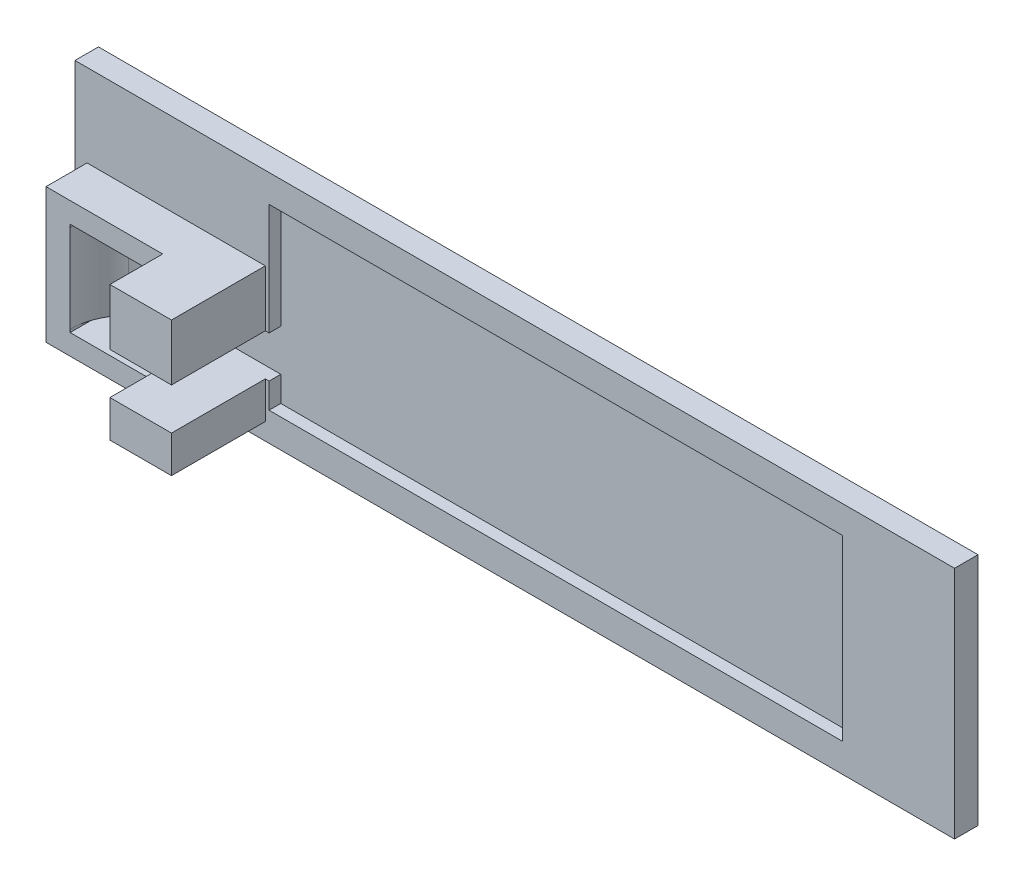
ISO-10303-21;
HEADER;
FILE_DESCRIPTION(('STEP AP214'),'2;1');
FILE_NAME('part.step','',(''),(''),'','','');
FILE_SCHEMA(('AUTOMOTIVE_DESIGN { 1 0 10303 214 1 1 1 1 }'));
ENDSEC;
DATA;
#1=APPLICATION_CONTEXT('core data for automotive mechanical design processes');
#2=APPLICATION_PROTOCOL_DEFINITION('international standard','automotive_design',2000,#1);
#3=PRODUCT_CONTEXT('',#1,'mechanical');
#4=PRODUCT('Part','Part','',(#3));
#5=PRODUCT_RELATED_PRODUCT_CATEGORY('part','',(#4));
#6=PRODUCT_DEFINITION_FORMATION('','',#4);
#7=PRODUCT_DEFINITION_CONTEXT('part definition',#1,'design');
#8=PRODUCT_DEFINITION('design','',#6,#7);
#9=PRODUCT_DEFINITION_SHAPE('','',#8);
#10=(LENGTH_UNIT() NAMED_UNIT(*) SI_UNIT(.MILLI.,.METRE.));
#11=(NAMED_UNIT(*) PLANE_ANGLE_UNIT() SI_UNIT($,.RADIAN.));
#12=(NAMED_UNIT(*) SI_UNIT($,.STERADIAN.) SOLID_ANGLE_UNIT());
#13=UNCERTAINTY_MEASURE_WITH_UNIT(LENGTH_MEASURE(1.E-05),#10,'distance_accuracy_value','');
#14=(GEOMETRIC_REPRESENTATION_CONTEXT(3) GLOBAL_UNCERTAINTY_ASSIGNED_CONTEXT((#13)) GLOBAL_UNIT_ASSIGNED_CONTEXT((#10,
#11,#12)) REPRESENTATION_CONTEXT('',''));
#15=CARTESIAN_POINT('',(0.,0.,0.));
#16=DIRECTION('',(0.,0.,1.));
#17=DIRECTION('',(1.,0.,0.));
#18=AXIS2_PLACEMENT_3D('',#15,#16,#17);
#19=CARTESIAN_POINT('',(0.,0.,9.));
#20=DIRECTION('',(0.,0.,-1.));
#21=DIRECTION('',(-1.,0.,0.));
#22=AXIS2_PLACEMENT_3D('',#19,#20,#21);
#23=PLANE('',#22);
#24=DIRECTION('',(0.,-1.,0.));
#25=VECTOR('',#24,1.);
#26=CARTESIAN_POINT('',(0.5,0.,9.));
#27=LINE('',#26,#25);
#28=CARTESIAN_POINT('',(0.5,-2.8,9.));
#29=VERTEX_POINT('',#28);
#30=CARTESIAN_POINT('',(0.5,-6.29709494860346,9.));
#31=VERTEX_POINT('',#30);
#32=EDGE_CURVE('E268',#29,#31,#27,.T.);
#33=ORIENTED_EDGE('',*,*,#32,.F.);
#34=DIRECTION('',(1.,0.,0.));
#35=VECTOR('',#34,1.);
#36=CARTESIAN_POINT('',(0.500000000000001,-2.8,9.));
#37=LINE('',#36,#35);
#38=CARTESIAN_POINT('',(-15.2908120194392,-2.8,9.));
#39=VERTEX_POINT('',#38);
#40=EDGE_CURVE('E372',#39,#29,#37,.T.);
#41=ORIENTED_EDGE('',*,*,#40,.F.);
#42=DIRECTION('',(0.,-1.,0.));
#43=VECTOR('',#42,1.);
#44=CARTESIAN_POINT('',(-15.2908120194392,-2.3,9.));
#45=LINE('',#44,#43);
#46=CARTESIAN_POINT('',(-15.2908120194392,-2.3,9.));
#47=VERTEX_POINT('',#46);
#48=EDGE_CURVE('E328',#47,#39,#45,.T.);
#49=ORIENTED_EDGE('',*,*,#48,.F.);
#50=DIRECTION('',(0.,-1.,0.));
#51=VECTOR('',#50,1.);
#52=CARTESIAN_POINT('',(-15.2908120194392,26.6352944540203,9.));
#53=LINE('',#52,#51);
#54=CARTESIAN_POINT('',(-15.2908120194392,12.7,9.));
#55=VERTEX_POINT('',#54);
#56=EDGE_CURVE('E406',#55,#47,#53,.T.);
#57=ORIENTED_EDGE('',*,*,#56,.F.);
#58=DIRECTION('',(0.,-1.,0.));
#59=VECTOR('',#58,1.);
#60=CARTESIAN_POINT('',(-15.2908120194392,12.7,9.));
#61=LINE('',#60,#59);
#62=CARTESIAN_POINT('',(-15.2908120194392,13.2,9.));
#63=VERTEX_POINT('',#62);
#64=EDGE_CURVE('E343',#63,#55,#61,.T.);
#65=ORIENTED_EDGE('',*,*,#64,.F.);
#66=DIRECTION('',(-1.,0.,0.));
#67=VECTOR('',#66,1.);
#68=CARTESIAN_POINT('',(-15.2908120194392,13.2,9.));
#69=LINE('',#68,#67);
#70=CARTESIAN_POINT('',(0.5,13.2,9.));
#71=VERTEX_POINT('',#70);
#72=EDGE_CURVE('E340',#71,#63,#69,.T.);
#73=ORIENTED_EDGE('',*,*,#72,.F.);
#74=DIRECTION('',(0.,-1.,0.));
#75=VECTOR('',#74,1.);
#76=CARTESIAN_POINT('',(0.5,7.1,9.));
#77=LINE('',#76,#75);
#78=CARTESIAN_POINT('',(0.5,16.6970991621456,9.));
#79=VERTEX_POINT('',#78);
#80=EDGE_CURVE('E277',#79,#71,#77,.T.);
#81=ORIENTED_EDGE('',*,*,#80,.F.);
#82=DIRECTION('',(-1.,0.,0.));
#83=VECTOR('',#82,1.);
#84=CARTESIAN_POINT('',(4.,16.6970991621456,9.));
#85=LINE('',#84,#83);
#86=CARTESIAN_POINT('',(-19.4000608526604,16.6970991621456,9.));
#87=VERTEX_POINT('',#86);
#88=EDGE_CURVE('E424',#79,#87,#85,.T.);
#89=ORIENTED_EDGE('',*,*,#88,.T.);
#90=DIRECTION('',(0.,-1.,0.));
#91=VECTOR('',#90,1.);
#92=CARTESIAN_POINT('',(-19.4000608526604,26.6352944540203,9.));
#93=LINE('',#92,#91);
#94=CARTESIAN_POINT('',(-19.4000608526604,-6.29709494860346,9.));
#95=VERTEX_POINT('',#94);
#96=EDGE_CURVE('E400',#87,#95,#93,.T.);
#97=ORIENTED_EDGE('',*,*,#96,.T.);
#98=DIRECTION('',(1.,0.,0.));
#99=VECTOR('',#98,1.);
#100=CARTESIAN_POINT('',(-12.3454364360499,-6.29709494860346,9.));
#101=LINE('',#100,#99);
#102=EDGE_CURVE('E251',#95,#31,#101,.T.);
#103=ORIENTED_EDGE('',*,*,#102,.T.);
#104=EDGE_LOOP('',(#33,#41,#49,#57,#65,#73,#81,#89,#97,#103));
#105=FACE_BOUND('',#104,.T.);
#106=ADVANCED_FACE('F34',(#105),#23,.F.);
#107=CARTESIAN_POINT('',(-5.5,-2.3,9.2));
#108=DIRECTION('',(0.,1.,0.));
#109=DIRECTION('',(0.,0.,1.));
#110=AXIS2_PLACEMENT_3D('',#107,#108,#109);
#111=PLANE('',#110);
#112=CARTESIAN_POINT('',(-5.5,-2.3,9.2));
#113=DIRECTION('',(0.,1.,0.));
#114=DIRECTION('',(0.,0.,1.));
#115=AXIS2_PLACEMENT_3D('',#112,#113,#114);
#116=CIRCLE('',#115,10.0404183179786);
#117=CARTESIAN_POINT('',(-1.47880614742339,-2.3,0.));
#118=VERTEX_POINT('',#117);
#119=CARTESIAN_POINT('',(-9.52119385257661,-2.3,0.));
#120=VERTEX_POINT('',#119);
#121=EDGE_CURVE('E438',#118,#120,#116,.T.);
#122=ORIENTED_EDGE('',*,*,#121,.T.);
#123=DIRECTION('',(1.,0.,0.));
#124=VECTOR('',#123,1.);
#125=CARTESIAN_POINT('',(-15.2908120194392,-2.3,0.));
#126=LINE('',#125,#124);
#127=EDGE_CURVE('E368',#120,#118,#126,.T.);
#128=ORIENTED_EDGE('',*,*,#127,.T.);
#129=EDGE_LOOP('',(#122,#128));
#130=FACE_BOUND('',#129,.T.);
#131=ADVANCED_FACE('F605',(#130),#111,.T.);
#132=CARTESIAN_POINT('',(-5.5,12.7,9.2));
#133=DIRECTION('',(0.,1.,0.));
#134=DIRECTION('',(0.,0.,1.));
#135=AXIS2_PLACEMENT_3D('',#132,#133,#134);
#136=PLANE('',#135);
#137=DIRECTION('',(-1.,0.,0.));
#138=VECTOR('',#137,1.);
#139=CARTESIAN_POINT('',(0.,12.7,0.));
#140=LINE('',#139,#138);
#141=CARTESIAN_POINT('',(-1.47880614742338,12.7,0.));
#142=VERTEX_POINT('',#141);
#143=CARTESIAN_POINT('',(-9.52119385257661,12.7,0.));
#144=VERTEX_POINT('',#143);
#145=EDGE_CURVE('E339',#142,#144,#140,.T.);
#146=ORIENTED_EDGE('',*,*,#145,.T.);
#147=CARTESIAN_POINT('',(-5.5,12.7,9.2));
#148=DIRECTION('',(0.,1.,0.));
#149=DIRECTION('',(0.,0.,1.));
#150=AXIS2_PLACEMENT_3D('',#147,#148,#149);
#151=CIRCLE('',#150,10.0404183179786);
#152=EDGE_CURVE('E434',#142,#144,#151,.T.);
#153=ORIENTED_EDGE('',*,*,#152,.F.);
#154=EDGE_LOOP('',(#146,#153));
#155=FACE_BOUND('',#154,.T.);
#156=ADVANCED_FACE('F588',(#155),#136,.F.);
#157=CARTESIAN_POINT('',(0.,0.,2.));
#158=DIRECTION('',(0.,0.,1.));
#159=DIRECTION('',(1.,0.,0.));
#160=AXIS2_PLACEMENT_3D('',#157,#158,#159);
#161=PLANE('',#160);
#162=DIRECTION('',(0.,-1.,0.));
#163=VECTOR('',#162,1.);
#164=CARTESIAN_POINT('',(11.6394275827029,7.1,2.));
#165=LINE('',#164,#163);
#166=CARTESIAN_POINT('',(11.6394275827029,26.1,2.));
#167=VERTEX_POINT('',#166);
#168=CARTESIAN_POINT('',(11.6394275827029,7.1,2.));
#169=VERTEX_POINT('',#168);
#170=EDGE_CURVE('E316',#167,#169,#165,.T.);
#171=ORIENTED_EDGE('',*,*,#170,.F.);
#172=DIRECTION('',(-1.,0.,0.));
#173=VECTOR('',#172,1.);
#174=CARTESIAN_POINT('',(11.6394275827029,26.1,2.));
#175=LINE('',#174,#173);
#176=CARTESIAN_POINT('',(109.411442142703,26.1,2.));
#177=VERTEX_POINT('',#176);
#178=EDGE_CURVE('E312',#177,#167,#175,.T.);
#179=ORIENTED_EDGE('',*,*,#178,.F.);
#180=DIRECTION('',(0.,1.,0.));
#181=VECTOR('',#180,1.);
#182=CARTESIAN_POINT('',(109.411442142703,26.1,2.));
#183=LINE('',#182,#181);
#184=CARTESIAN_POINT('',(109.411442142703,-4.30823185,2.));
#185=VERTEX_POINT('',#184);
#186=EDGE_CURVE('E309',#185,#177,#183,.T.);
#187=ORIENTED_EDGE('',*,*,#186,.F.);
#188=DIRECTION('',(1.,0.,0.));
#189=VECTOR('',#188,1.);
#190=CARTESIAN_POINT('',(11.6394275827029,-4.30823185,2.));
#191=LINE('',#190,#189);
#192=CARTESIAN_POINT('',(11.6394275827029,-4.30823185,2.));
#193=VERTEX_POINT('',#192);
#194=EDGE_CURVE('E292',#193,#185,#191,.T.);
#195=ORIENTED_EDGE('',*,*,#194,.F.);
#196=CARTESIAN_POINT('',(11.6394275827029,0.,2.));
#197=VERTEX_POINT('',#196);
#198=EDGE_CURVE('E315',#197,#193,#165,.T.);
#199=ORIENTED_EDGE('',*,*,#198,.F.);
#200=DIRECTION('',(1.,0.,0.));
#201=VECTOR('',#200,1.);
#202=CARTESIAN_POINT('',(12.1958891942608,0.,2.));
#203=LINE('',#202,#201);
#204=CARTESIAN_POINT('',(11.,0.,2.));
#205=VERTEX_POINT('',#204);
#206=EDGE_CURVE('E462',#205,#197,#203,.T.);
#207=ORIENTED_EDGE('',*,*,#206,.F.);
#208=DIRECTION('',(0.,-1.,0.));
#209=VECTOR('',#208,1.);
#210=CARTESIAN_POINT('',(11.,0.,2.));
#211=LINE('',#210,#209);
#212=CARTESIAN_POINT('',(11.,-6.29709494860346,2.));
#213=VERTEX_POINT('',#212);
#214=EDGE_CURVE('E247',#205,#213,#211,.T.);
#215=ORIENTED_EDGE('',*,*,#214,.T.);
#216=DIRECTION('',(-1.,0.,0.));
#217=VECTOR('',#216,1.);
#218=CARTESIAN_POINT('',(0.,-6.29709494860346,2.));
#219=LINE('',#218,#217);
#220=CARTESIAN_POINT('',(-19.4000608526604,-6.29709494860346,2.));
#221=VERTEX_POINT('',#220);
#222=EDGE_CURVE('E11',#213,#221,#219,.T.);
#223=ORIENTED_EDGE('',*,*,#222,.T.);
#224=DIRECTION('',(0.,-1.,0.));
#225=VECTOR('',#224,1.);
#226=CARTESIAN_POINT('',(-19.4000608526604,26.6352944540203,2.));
#227=LINE('',#226,#225);
#228=CARTESIAN_POINT('',(-19.4000608526604,16.6970991621456,2.));
#229=VERTEX_POINT('',#228);
#230=EDGE_CURVE('E395',#229,#221,#227,.T.);
#231=ORIENTED_EDGE('',*,*,#230,.F.);
#232=DIRECTION('',(1.,0.,0.));
#233=VECTOR('',#232,1.);
#234=CARTESIAN_POINT('',(0.,16.6970991621456,2.));
#235=LINE('',#234,#233);
#236=CARTESIAN_POINT('',(11.,16.6970991621456,2.));
#237=VERTEX_POINT('',#236);
#238=EDGE_CURVE('E42',#229,#237,#235,.T.);
#239=ORIENTED_EDGE('',*,*,#238,.T.);
#240=DIRECTION('',(0.,-1.,0.));
#241=VECTOR('',#240,1.);
#242=CARTESIAN_POINT('',(11.,0.,2.));
#243=LINE('',#242,#241);
#244=CARTESIAN_POINT('',(11.,7.1,2.));
#245=VERTEX_POINT('',#244);
#246=EDGE_CURVE('E431',#237,#245,#243,.T.);
#247=ORIENTED_EDGE('',*,*,#246,.T.);
#248=DIRECTION('',(-1.,0.,0.));
#249=VECTOR('',#248,1.);
#250=CARTESIAN_POINT('',(11.6394275827029,7.1,2.));
#251=LINE('',#250,#249);
#252=EDGE_CURVE('E459',#169,#245,#251,.T.);
#253=ORIENTED_EDGE('',*,*,#252,.F.);
#254=EDGE_LOOP('',(#171,#179,#187,#195,#199,#207,#215,#223,#231,#239,#247,#253));
#255=FACE_BOUND('',#254,.T.);
#256=DIRECTION('',(0.,-1.,0.));
#257=VECTOR('',#256,1.);
#258=CARTESIAN_POINT('',(-21.4577063823923,30.8029359885804,2.));
#259=LINE('',#258,#257);
#260=CARTESIAN_POINT('',(-21.4577063823923,30.8029359885804,2.));
#261=VERTEX_POINT('',#260);
#262=CARTESIAN_POINT('',(-21.4577063823923,-9.19706401141962,2.));
#263=VERTEX_POINT('',#262);
#264=EDGE_CURVE('E473',#261,#263,#259,.T.);
#265=ORIENTED_EDGE('',*,*,#264,.T.);
#266=DIRECTION('',(1.,0.,0.));
#267=VECTOR('',#266,1.);
#268=CARTESIAN_POINT('',(-21.4577063823923,-9.19706401141962,2.));
#269=LINE('',#268,#267);
#270=CARTESIAN_POINT('',(128.542293617608,-9.19706401141962,2.));
#271=VERTEX_POINT('',#270);
#272=EDGE_CURVE('E475',#263,#271,#269,.T.);
#273=ORIENTED_EDGE('',*,*,#272,.T.);
#274=DIRECTION('',(0.,1.,0.));
#275=VECTOR('',#274,1.);
#276=CARTESIAN_POINT('',(128.542293617608,30.8029359885804,2.));
#277=LINE('',#276,#275);
#278=CARTESIAN_POINT('',(128.542293617608,30.8029359885804,2.));
#279=VERTEX_POINT('',#278);
#280=EDGE_CURVE('E477',#271,#279,#277,.T.);
#281=ORIENTED_EDGE('',*,*,#280,.T.);
#282=DIRECTION('',(-1.,0.,0.));
#283=VECTOR('',#282,1.);
#284=CARTESIAN_POINT('',(-21.4577063823923,30.8029359885804,2.));
#285=LINE('',#284,#283);
#286=EDGE_CURVE('E57',#279,#261,#285,.T.);
#287=ORIENTED_EDGE('',*,*,#286,.T.);
#288=EDGE_LOOP('',(#265,#273,#281,#287));
#289=FACE_BOUND('',#288,.T.);
#290=ADVANCED_FACE('F491',(#255,#289),#161,.T.);
#291=CARTESIAN_POINT('',(-21.4577063823923,30.8029359885804,2.));
#292=DIRECTION('',(1.,0.,0.));
#293=DIRECTION('',(0.,0.,-1.));
#294=AXIS2_PLACEMENT_3D('',#291,#292,#293);
#295=PLANE('',#294);
#296=DIRECTION('',(0.,0.,-1.));
#297=VECTOR('',#296,1.);
#298=CARTESIAN_POINT('',(-21.4577063823923,30.8029359885804,2.));
#299=LINE('',#298,#297);
#300=CARTESIAN_POINT('',(-21.4577063823923,30.8029359885804,-2.));
#301=VERTEX_POINT('',#300);
#302=EDGE_CURVE('E480',#261,#301,#299,.T.);
#303=ORIENTED_EDGE('',*,*,#302,.T.);
#304=DIRECTION('',(0.,-1.,0.));
#305=VECTOR('',#304,1.);
#306=CARTESIAN_POINT('',(-21.4577063823923,30.8029359885804,-2.));
#307=LINE('',#306,#305);
#308=CARTESIAN_POINT('',(-21.4577063823923,-9.19706401141962,-2.));
#309=VERTEX_POINT('',#308);
#310=EDGE_CURVE('E446',#301,#309,#307,.T.);
#311=ORIENTED_EDGE('',*,*,#310,.T.);
#312=DIRECTION('',(0.,0.,-1.));
#313=VECTOR('',#312,1.);
#314=CARTESIAN_POINT('',(-21.4577063823923,-9.19706401141962,2.));
#315=LINE('',#314,#313);
#316=EDGE_CURVE('E486',#263,#309,#315,.T.);
#317=ORIENTED_EDGE('',*,*,#316,.F.);
#318=ORIENTED_EDGE('',*,*,#264,.F.);
#319=EDGE_LOOP('',(#303,#311,#317,#318));
#320=FACE_BOUND('',#319,.T.);
#321=ADVANCED_FACE('F36',(#320),#295,.F.);
#322=CARTESIAN_POINT('',(-21.4577063823923,-9.19706401141962,2.));
#323=DIRECTION('',(0.,1.,0.));
#324=DIRECTION('',(0.,0.,1.));
#325=AXIS2_PLACEMENT_3D('',#322,#323,#324);
#326=PLANE('',#325);
#327=ORIENTED_EDGE('',*,*,#316,.T.);
#328=DIRECTION('',(1.,0.,0.));
#329=VECTOR('',#328,1.);
#330=CARTESIAN_POINT('',(-21.4577063823923,-9.19706401141962,-2.));
#331=LINE('',#330,#329);
#332=CARTESIAN_POINT('',(128.542293617608,-9.19706401141962,-2.));
#333=VERTEX_POINT('',#332);
#334=EDGE_CURVE('E449',#309,#333,#331,.T.);
#335=ORIENTED_EDGE('',*,*,#334,.T.);
#336=DIRECTION('',(0.,0.,-1.));
#337=VECTOR('',#336,1.);
#338=CARTESIAN_POINT('',(128.542293617608,-9.19706401141962,2.));
#339=LINE('',#338,#337);
#340=EDGE_CURVE('E484',#271,#333,#339,.T.);
#341=ORIENTED_EDGE('',*,*,#340,.F.);
#342=ORIENTED_EDGE('',*,*,#272,.F.);
#343=EDGE_LOOP('',(#327,#335,#341,#342));
#344=FACE_BOUND('',#343,.T.);
#345=ADVANCED_FACE('F638',(#344),#326,.F.);
#346=CARTESIAN_POINT('',(128.542293617608,30.8029359885804,2.));
#347=DIRECTION('',(-1.,0.,0.));
#348=DIRECTION('',(0.,0.,1.));
#349=AXIS2_PLACEMENT_3D('',#346,#347,#348);
#350=PLANE('',#349);
#351=ORIENTED_EDGE('',*,*,#340,.T.);
#352=DIRECTION('',(0.,1.,0.));
#353=VECTOR('',#352,1.);
#354=CARTESIAN_POINT('',(128.542293617608,30.8029359885804,-2.));
#355=LINE('',#354,#353);
#356=CARTESIAN_POINT('',(128.542293617608,30.8029359885804,-2.));
#357=VERTEX_POINT('',#356);
#358=EDGE_CURVE('E452',#333,#357,#355,.T.);
#359=ORIENTED_EDGE('',*,*,#358,.T.);
#360=DIRECTION('',(0.,0.,-1.));
#361=VECTOR('',#360,1.);
#362=CARTESIAN_POINT('',(128.542293617608,30.8029359885804,2.));
#363=LINE('',#362,#361);
#364=EDGE_CURVE('E482',#279,#357,#363,.T.);
#365=ORIENTED_EDGE('',*,*,#364,.F.);
#366=ORIENTED_EDGE('',*,*,#280,.F.);
#367=EDGE_LOOP('',(#351,#359,#365,#366));
#368=FACE_BOUND('',#367,.T.);
#369=ADVANCED_FACE('F635',(#368),#350,.F.);
#370=CARTESIAN_POINT('',(-21.4577063823923,30.8029359885804,2.));
#371=DIRECTION('',(0.,-1.,0.));
#372=DIRECTION('',(0.,0.,-1.));
#373=AXIS2_PLACEMENT_3D('',#370,#371,#372);
#374=PLANE('',#373);
#375=ORIENTED_EDGE('',*,*,#364,.T.);
#376=DIRECTION('',(-1.,0.,0.));
#377=VECTOR('',#376,1.);
#378=CARTESIAN_POINT('',(-21.4577063823923,30.8029359885804,-2.));
#379=LINE('',#378,#377);
#380=EDGE_CURVE('E455',#357,#301,#379,.T.);
#381=ORIENTED_EDGE('',*,*,#380,.T.);
#382=ORIENTED_EDGE('',*,*,#302,.F.);
#383=ORIENTED_EDGE('',*,*,#286,.F.);
#384=EDGE_LOOP('',(#375,#381,#382,#383));
#385=FACE_BOUND('',#384,.T.);
#386=ADVANCED_FACE('F630',(#385),#374,.F.);
#387=CARTESIAN_POINT('',(11.6394275827029,7.1,2.));
#388=DIRECTION('',(0.,-1.,0.));
#389=DIRECTION('',(0.,0.,-1.));
#390=AXIS2_PLACEMENT_3D('',#387,#388,#389);
#391=PLANE('',#390);
#392=DIRECTION('',(0.,0.,1.));
#393=VECTOR('',#392,1.);
#394=CARTESIAN_POINT('',(0.5,7.1,-16.9280756210877));
#395=LINE('',#394,#393);
#396=CARTESIAN_POINT('',(0.5,7.1,0.));
#397=VERTEX_POINT('',#396);
#398=CARTESIAN_POINT('',(0.5,7.1,18.));
#399=VERTEX_POINT('',#398);
#400=EDGE_CURVE('E346',#397,#399,#395,.T.);
#401=ORIENTED_EDGE('',*,*,#400,.F.);
#402=DIRECTION('',(-1.,0.,0.));
#403=VECTOR('',#402,1.);
#404=CARTESIAN_POINT('',(11.6394275827029,7.1,0.));
#405=LINE('',#404,#403);
#406=CARTESIAN_POINT('',(11.6394275827029,7.1,0.));
#407=VERTEX_POINT('',#406);
#408=EDGE_CURVE('E458',#407,#397,#405,.T.);
#409=ORIENTED_EDGE('',*,*,#408,.F.);
#410=DIRECTION('',(0.,0.,-1.));
#411=VECTOR('',#410,1.);
#412=CARTESIAN_POINT('',(11.6394275827029,7.1,2.));
#413=LINE('',#412,#411);
#414=EDGE_CURVE('E465',#169,#407,#413,.T.);
#415=ORIENTED_EDGE('',*,*,#414,.F.);
#416=ORIENTED_EDGE('',*,*,#252,.T.);
#417=DIRECTION('',(0.,0.,-1.));
#418=VECTOR('',#417,1.);
#419=CARTESIAN_POINT('',(11.,7.1,9.));
#420=LINE('',#419,#418);
#421=CARTESIAN_POINT('',(11.,7.1,18.));
#422=VERTEX_POINT('',#421);
#423=EDGE_CURVE('E429',#422,#245,#420,.T.);
#424=ORIENTED_EDGE('',*,*,#423,.F.);
#425=DIRECTION('',(1.,0.,0.));
#426=VECTOR('',#425,1.);
#427=CARTESIAN_POINT('',(0.5,7.1,18.));
#428=LINE('',#427,#426);
#429=EDGE_CURVE('E281',#399,#422,#428,.T.);
#430=ORIENTED_EDGE('',*,*,#429,.F.);
#431=EDGE_LOOP('',(#401,#409,#415,#416,#424,#430));
#432=FACE_BOUND('',#431,.T.);
#433=ADVANCED_FACE('F508',(#432),#391,.T.);
#434=CARTESIAN_POINT('',(0.,7.1,2.));
#435=DIRECTION('',(1.,0.,0.));
#436=DIRECTION('',(0.,0.,-1.));
#437=AXIS2_PLACEMENT_3D('',#434,#435,#436);
#438=PLANE('',#437);
#439=DIRECTION('',(0.,0.,1.));
#440=VECTOR('',#439,1.);
#441=CARTESIAN_POINT('',(0.,12.7,-16.9280756210877));
#442=LINE('',#441,#440);
#443=CARTESIAN_POINT('',(0.,12.7,0.));
#444=VERTEX_POINT('',#443);
#445=CARTESIAN_POINT('',(0.,12.7,0.799999999999999));
#446=VERTEX_POINT('',#445);
#447=EDGE_CURVE('E332',#444,#446,#442,.T.);
#448=ORIENTED_EDGE('',*,*,#447,.T.);
#449=DIRECTION('',(0.,1.,0.));
#450=VECTOR('',#449,1.);
#451=CARTESIAN_POINT('',(0.,-2.3,0.799999999999999));
#452=LINE('',#451,#450);
#453=CARTESIAN_POINT('',(0.,-2.3,0.800000000000002));
#454=VERTEX_POINT('',#453);
#455=EDGE_CURVE('E441',#454,#446,#452,.T.);
#456=ORIENTED_EDGE('',*,*,#455,.F.);
#457=DIRECTION('',(0.,0.,1.));
#458=VECTOR('',#457,1.);
#459=CARTESIAN_POINT('',(0.,-2.3,-16.9280756210877));
#460=LINE('',#459,#458);
#461=CARTESIAN_POINT('',(0.,-2.3,0.));
#462=VERTEX_POINT('',#461);
#463=EDGE_CURVE('E378',#462,#454,#460,.T.);
#464=ORIENTED_EDGE('',*,*,#463,.F.);
#465=DIRECTION('',(0.,-1.,0.));
#466=VECTOR('',#465,1.);
#467=CARTESIAN_POINT('',(0.,7.1,0.));
#468=LINE('',#467,#466);
#469=EDGE_CURVE('E468',#444,#462,#468,.T.);
#470=ORIENTED_EDGE('',*,*,#469,.F.);
#471=EDGE_LOOP('',(#448,#456,#464,#470));
#472=FACE_BOUND('',#471,.T.);
#473=ADVANCED_FACE('F594',(#472),#438,.T.);
#474=CARTESIAN_POINT('',(12.1958891942608,0.,2.));
#475=DIRECTION('',(0.,1.,0.));
#476=DIRECTION('',(0.,0.,1.));
#477=AXIS2_PLACEMENT_3D('',#474,#475,#476);
#478=PLANE('',#477);
#479=DIRECTION('',(0.,0.,1.));
#480=VECTOR('',#479,1.);
#481=CARTESIAN_POINT('',(11.6394275827029,0.,2.));
#482=LINE('',#481,#480);
#483=CARTESIAN_POINT('',(11.6394275827029,0.,0.));
#484=VERTEX_POINT('',#483);
#485=EDGE_CURVE('E320',#484,#197,#482,.T.);
#486=ORIENTED_EDGE('',*,*,#485,.F.);
#487=DIRECTION('',(1.,0.,0.));
#488=VECTOR('',#487,1.);
#489=CARTESIAN_POINT('',(12.1958891942608,0.,0.));
#490=LINE('',#489,#488);
#491=CARTESIAN_POINT('',(0.500000000000001,0.,0.));
#492=VERTEX_POINT('',#491);
#493=EDGE_CURVE('E463',#492,#484,#490,.T.);
#494=ORIENTED_EDGE('',*,*,#493,.F.);
#495=DIRECTION('',(0.,0.,1.));
#496=VECTOR('',#495,1.);
#497=CARTESIAN_POINT('',(0.500000000000001,0.,-16.9280756210877));
#498=LINE('',#497,#496);
#499=CARTESIAN_POINT('',(0.5,0.,18.));
#500=VERTEX_POINT('',#499);
#501=EDGE_CURVE('E259',#492,#500,#498,.T.);
#502=ORIENTED_EDGE('',*,*,#501,.T.);
#503=DIRECTION('',(-1.,0.,0.));
#504=VECTOR('',#503,1.);
#505=CARTESIAN_POINT('',(11.,0.,18.));
#506=LINE('',#505,#504);
#507=CARTESIAN_POINT('',(11.,0.,18.));
#508=VERTEX_POINT('',#507);
#509=EDGE_CURVE('E254',#508,#500,#506,.T.);
#510=ORIENTED_EDGE('',*,*,#509,.F.);
#511=DIRECTION('',(0.,0.,-1.));
#512=VECTOR('',#511,1.);
#513=CARTESIAN_POINT('',(11.,0.,9.));
#514=LINE('',#513,#512);
#515=EDGE_CURVE('E241',#508,#205,#514,.T.);
#516=ORIENTED_EDGE('',*,*,#515,.T.);
#517=ORIENTED_EDGE('',*,*,#206,.T.);
#518=EDGE_LOOP('',(#486,#494,#502,#510,#516,#517));
#519=FACE_BOUND('',#518,.T.);
#520=ADVANCED_FACE('F256',(#519),#478,.T.);
#521=CARTESIAN_POINT('',(0.,0.,0.));
#522=DIRECTION('',(0.,0.,1.));
#523=DIRECTION('',(1.,0.,0.));
#524=AXIS2_PLACEMENT_3D('',#521,#522,#523);
#525=PLANE('',#524);
#526=DIRECTION('',(0.,-1.,0.));
#527=VECTOR('',#526,1.);
#528=CARTESIAN_POINT('',(11.6394275827029,7.1,0.));
#529=LINE('',#528,#527);
#530=CARTESIAN_POINT('',(11.6394275827029,26.1,0.));
#531=VERTEX_POINT('',#530);
#532=EDGE_CURVE('E293',#531,#407,#529,.T.);
#533=ORIENTED_EDGE('',*,*,#532,.T.);
#534=ORIENTED_EDGE('',*,*,#408,.T.);
#535=DIRECTION('',(0.,-1.,0.));
#536=VECTOR('',#535,1.);
#537=CARTESIAN_POINT('',(0.5,13.2,0.));
#538=LINE('',#537,#536);
#539=CARTESIAN_POINT('',(0.5,13.2,0.));
#540=VERTEX_POINT('',#539);
#541=EDGE_CURVE('E338',#540,#397,#538,.T.);
#542=ORIENTED_EDGE('',*,*,#541,.F.);
#543=DIRECTION('',(1.,0.,0.));
#544=VECTOR('',#543,1.);
#545=CARTESIAN_POINT('',(-15.2908120194392,13.2,0.));
#546=LINE('',#545,#544);
#547=CARTESIAN_POINT('',(-15.2908120194392,13.2,0.));
#548=VERTEX_POINT('',#547);
#549=EDGE_CURVE('E329',#548,#540,#546,.T.);
#550=ORIENTED_EDGE('',*,*,#549,.F.);
#551=DIRECTION('',(0.,1.,0.));
#552=VECTOR('',#551,1.);
#553=CARTESIAN_POINT('',(-15.2908120194392,12.7,0.));
#554=LINE('',#553,#552);
#555=CARTESIAN_POINT('',(-15.2908120194392,12.7,0.));
#556=VERTEX_POINT('',#555);
#557=EDGE_CURVE('E331',#556,#548,#554,.T.);
#558=ORIENTED_EDGE('',*,*,#557,.F.);
#559=EDGE_CURVE('E334',#144,#556,#140,.T.);
#560=ORIENTED_EDGE('',*,*,#559,.F.);
#561=ORIENTED_EDGE('',*,*,#145,.F.);
#562=EDGE_CURVE('E335',#444,#142,#140,.T.);
#563=ORIENTED_EDGE('',*,*,#562,.F.);
#564=ORIENTED_EDGE('',*,*,#469,.T.);
#565=EDGE_CURVE('E362',#118,#462,#126,.T.);
#566=ORIENTED_EDGE('',*,*,#565,.F.);
#567=ORIENTED_EDGE('',*,*,#127,.F.);
#568=CARTESIAN_POINT('',(-15.2908120194392,-2.3,0.));
#569=VERTEX_POINT('',#568);
#570=EDGE_CURVE('E364',#569,#120,#126,.T.);
#571=ORIENTED_EDGE('',*,*,#570,.F.);
#572=DIRECTION('',(0.,1.,0.));
#573=VECTOR('',#572,1.);
#574=CARTESIAN_POINT('',(-15.2908120194392,-2.3,0.));
#575=LINE('',#574,#573);
#576=CARTESIAN_POINT('',(-15.2908120194392,-2.8,0.));
#577=VERTEX_POINT('',#576);
#578=EDGE_CURVE('E367',#577,#569,#575,.T.);
#579=ORIENTED_EDGE('',*,*,#578,.F.);
#580=DIRECTION('',(-1.,0.,0.));
#581=VECTOR('',#580,1.);
#582=CARTESIAN_POINT('',(0.500000000000001,-2.8,0.));
#583=LINE('',#582,#581);
#584=CARTESIAN_POINT('',(0.500000000000001,-2.8,0.));
#585=VERTEX_POINT('',#584);
#586=EDGE_CURVE('E344',#585,#577,#583,.T.);
#587=ORIENTED_EDGE('',*,*,#586,.F.);
#588=DIRECTION('',(0.,-1.,0.));
#589=VECTOR('',#588,1.);
#590=CARTESIAN_POINT('',(0.500000000000001,0.,0.));
#591=LINE('',#590,#589);
#592=EDGE_CURVE('E360',#492,#585,#591,.T.);
#593=ORIENTED_EDGE('',*,*,#592,.F.);
#594=ORIENTED_EDGE('',*,*,#493,.T.);
#595=CARTESIAN_POINT('',(11.6394275827029,-4.30823185,0.));
#596=VERTEX_POINT('',#595);
#597=EDGE_CURVE('E297',#484,#596,#529,.T.);
#598=ORIENTED_EDGE('',*,*,#597,.T.);
#599=DIRECTION('',(1.,0.,0.));
#600=VECTOR('',#599,1.);
#601=CARTESIAN_POINT('',(11.6394275827029,-4.30823185,0.));
#602=LINE('',#601,#600);
#603=CARTESIAN_POINT('',(109.411442142703,-4.30823185,0.));
#604=VERTEX_POINT('',#603);
#605=EDGE_CURVE('E296',#596,#604,#602,.T.);
#606=ORIENTED_EDGE('',*,*,#605,.T.);
#607=DIRECTION('',(0.,1.,0.));
#608=VECTOR('',#607,1.);
#609=CARTESIAN_POINT('',(109.411442142703,26.1,0.));
#610=LINE('',#609,#608);
#611=CARTESIAN_POINT('',(109.411442142703,26.1,0.));
#612=VERTEX_POINT('',#611);
#613=EDGE_CURVE('E300',#604,#612,#610,.T.);
#614=ORIENTED_EDGE('',*,*,#613,.T.);
#615=DIRECTION('',(-1.,0.,0.));
#616=VECTOR('',#615,1.);
#617=CARTESIAN_POINT('',(11.6394275827029,26.1,0.));
#618=LINE('',#617,#616);
#619=EDGE_CURVE('E303',#612,#531,#618,.T.);
#620=ORIENTED_EDGE('',*,*,#619,.T.);
#621=EDGE_LOOP('',(#533,#534,#542,#550,#558,#560,#561,#563,#564,#566,#567,#571,#579,#587,#593,
#594,#598,#606,#614,#620));
#622=FACE_BOUND('',#621,.T.);
#623=ADVANCED_FACE('F531',(#622),#525,.T.);
#624=CARTESIAN_POINT('',(0.,0.,-2.));
#625=DIRECTION('',(0.,0.,1.));
#626=DIRECTION('',(1.,0.,0.));
#627=AXIS2_PLACEMENT_3D('',#624,#625,#626);
#628=PLANE('',#627);
#629=ORIENTED_EDGE('',*,*,#310,.F.);
#630=ORIENTED_EDGE('',*,*,#380,.F.);
#631=ORIENTED_EDGE('',*,*,#358,.F.);
#632=ORIENTED_EDGE('',*,*,#334,.F.);
#633=EDGE_LOOP('',(#629,#630,#631,#632));
#634=FACE_BOUND('',#633,.T.);
#635=ADVANCED_FACE('F618',(#634),#628,.F.);
#636=CARTESIAN_POINT('',(-5.5,-2.3,9.2));
#637=DIRECTION('',(0.,1.,0.));
#638=DIRECTION('',(0.,0.,1.));
#639=AXIS2_PLACEMENT_3D('',#636,#637,#638);
#640=CYLINDRICAL_SURFACE('',#639,10.0404183179786);
#641=DIRECTION('',(0.,1.,0.));
#642=VECTOR('',#641,1.);
#643=CARTESIAN_POINT('',(-12.4978568147684,-2.3,2.));
#644=LINE('',#643,#642);
#645=CARTESIAN_POINT('',(-12.4978568147684,12.7,2.));
#646=VERTEX_POINT('',#645);
#647=CARTESIAN_POINT('',(-12.4978568147684,-2.3,2.));
#648=VERTEX_POINT('',#647);
#649=EDGE_CURVE('E443',#646,#648,#644,.F.);
#650=ORIENTED_EDGE('',*,*,#649,.T.);
#651=CARTESIAN_POINT('',(-5.5,-2.3,9.2));
#652=DIRECTION('',(0.,1.,0.));
#653=DIRECTION('',(0.,0.,1.));
#654=AXIS2_PLACEMENT_3D('',#651,#652,#653);
#655=CIRCLE('',#654,10.0404183179786);
#656=EDGE_CURVE('E359',#648,#120,#655,.F.);
#657=ORIENTED_EDGE('',*,*,#656,.T.);
#658=ORIENTED_EDGE('',*,*,#121,.F.);
#659=EDGE_CURVE('E439',#454,#118,#116,.T.);
#660=ORIENTED_EDGE('',*,*,#659,.F.);
#661=ORIENTED_EDGE('',*,*,#455,.T.);
#662=EDGE_CURVE('E435',#446,#142,#151,.T.);
#663=ORIENTED_EDGE('',*,*,#662,.T.);
#664=ORIENTED_EDGE('',*,*,#152,.T.);
#665=CARTESIAN_POINT('',(-5.5,12.7,9.2));
#666=DIRECTION('',(0.,-1.,0.));
#667=DIRECTION('',(1.,0.,0.));
#668=AXIS2_PLACEMENT_3D('',#665,#666,#667);
#669=CIRCLE('',#668,10.0404183179786);
#670=EDGE_CURVE('E389',#144,#646,#669,.F.);
#671=ORIENTED_EDGE('',*,*,#670,.T.);
#672=EDGE_LOOP('',(#650,#657,#658,#660,#661,#663,#664,#671));
#673=FACE_BOUND('',#672,.T.);
#674=ADVANCED_FACE('F584',(#673),#640,.F.);
#675=CARTESIAN_POINT('',(11.,16.6970991621456,9.));
#676=DIRECTION('',(-1.,0.,0.));
#677=DIRECTION('',(0.,0.,1.));
#678=AXIS2_PLACEMENT_3D('',#675,#676,#677);
#679=PLANE('',#678);
#680=ORIENTED_EDGE('',*,*,#246,.F.);
#681=DIRECTION('',(0.,0.,-1.));
#682=VECTOR('',#681,1.);
#683=CARTESIAN_POINT('',(11.,16.6970991621456,9.));
#684=LINE('',#683,#682);
#685=CARTESIAN_POINT('',(11.,16.6970991621456,18.));
#686=VERTEX_POINT('',#685);
#687=EDGE_CURVE('E426',#686,#237,#684,.T.);
#688=ORIENTED_EDGE('',*,*,#687,.F.);
#689=DIRECTION('',(0.,1.,0.));
#690=VECTOR('',#689,1.);
#691=CARTESIAN_POINT('',(11.,7.1,18.));
#692=LINE('',#691,#690);
#693=EDGE_CURVE('E284',#422,#686,#692,.T.);
#694=ORIENTED_EDGE('',*,*,#693,.F.);
#695=ORIENTED_EDGE('',*,*,#423,.T.);
#696=EDGE_LOOP('',(#680,#688,#694,#695));
#697=FACE_BOUND('',#696,.T.);
#698=ADVANCED_FACE('F496',(#697),#679,.F.);
#699=CARTESIAN_POINT('',(-12.345546972751,16.6970991621456,9.));
#700=DIRECTION('',(0.,-1.,0.));
#701=DIRECTION('',(0.,0.,-1.));
#702=AXIS2_PLACEMENT_3D('',#699,#700,#701);
#703=PLANE('',#702);
#704=DIRECTION('',(0.,0.,-1.));
#705=VECTOR('',#704,1.);
#706=CARTESIAN_POINT('',(-19.4000608526604,16.6970991621456,9.));
#707=LINE('',#706,#705);
#708=EDGE_CURVE('E396',#87,#229,#707,.T.);
#709=ORIENTED_EDGE('',*,*,#708,.F.);
#710=ORIENTED_EDGE('',*,*,#88,.F.);
#711=DIRECTION('',(0.,0.,-1.));
#712=VECTOR('',#711,1.);
#713=CARTESIAN_POINT('',(0.5,16.6970991621456,18.));
#714=LINE('',#713,#712);
#715=CARTESIAN_POINT('',(0.5,16.6970991621456,18.));
#716=VERTEX_POINT('',#715);
#717=EDGE_CURVE('E289',#716,#79,#714,.T.);
#718=ORIENTED_EDGE('',*,*,#717,.F.);
#719=DIRECTION('',(-1.,0.,0.));
#720=VECTOR('',#719,1.);
#721=CARTESIAN_POINT('',(0.5,16.6970991621456,18.));
#722=LINE('',#721,#720);
#723=EDGE_CURVE('E287',#686,#716,#722,.T.);
#724=ORIENTED_EDGE('',*,*,#723,.F.);
#725=ORIENTED_EDGE('',*,*,#687,.T.);
#726=ORIENTED_EDGE('',*,*,#238,.F.);
#727=EDGE_LOOP('',(#709,#710,#718,#724,#725,#726));
#728=FACE_BOUND('',#727,.T.);
#729=ADVANCED_FACE('F499',(#728),#703,.F.);
#730=CARTESIAN_POINT('',(4.,-6.29709494860346,9.));
#731=DIRECTION('',(0.,1.,0.));
#732=DIRECTION('',(0.,0.,1.));
#733=AXIS2_PLACEMENT_3D('',#730,#731,#732);
#734=PLANE('',#733);
#735=DIRECTION('',(0.,0.,-1.));
#736=VECTOR('',#735,1.);
#737=CARTESIAN_POINT('',(-19.4000608526604,-6.29709494860346,9.));
#738=LINE('',#737,#736);
#739=EDGE_CURVE('E392',#95,#221,#738,.T.);
#740=ORIENTED_EDGE('',*,*,#739,.T.);
#741=ORIENTED_EDGE('',*,*,#222,.F.);
#742=DIRECTION('',(0.,0.,-1.));
#743=VECTOR('',#742,1.);
#744=CARTESIAN_POINT('',(11.,-6.29709494860346,9.));
#745=LINE('',#744,#743);
#746=CARTESIAN_POINT('',(11.,-6.29709494860346,18.));
#747=VERTEX_POINT('',#746);
#748=EDGE_CURVE('E49',#747,#213,#745,.T.);
#749=ORIENTED_EDGE('',*,*,#748,.F.);
#750=DIRECTION('',(1.,0.,0.));
#751=VECTOR('',#750,1.);
#752=CARTESIAN_POINT('',(11.,-6.29709494860346,18.));
#753=LINE('',#752,#751);
#754=CARTESIAN_POINT('',(0.5,-6.29709494860346,18.));
#755=VERTEX_POINT('',#754);
#756=EDGE_CURVE('E267',#755,#747,#753,.T.);
#757=ORIENTED_EDGE('',*,*,#756,.F.);
#758=DIRECTION('',(0.,0.,-1.));
#759=VECTOR('',#758,1.);
#760=CARTESIAN_POINT('',(0.5,-6.29709494860346,18.));
#761=LINE('',#760,#759);
#762=EDGE_CURVE('E273',#755,#31,#761,.T.);
#763=ORIENTED_EDGE('',*,*,#762,.T.);
#764=ORIENTED_EDGE('',*,*,#102,.F.);
#765=EDGE_LOOP('',(#740,#741,#749,#757,#763,#764));
#766=FACE_BOUND('',#765,.T.);
#767=ADVANCED_FACE('F539',(#766),#734,.F.);
#768=CARTESIAN_POINT('',(11.,-6.29709494860346,9.));
#769=DIRECTION('',(-1.,0.,0.));
#770=DIRECTION('',(0.,0.,1.));
#771=AXIS2_PLACEMENT_3D('',#768,#769,#770);
#772=PLANE('',#771);
#773=ORIENTED_EDGE('',*,*,#214,.F.);
#774=ORIENTED_EDGE('',*,*,#515,.F.);
#775=DIRECTION('',(0.,1.,0.));
#776=VECTOR('',#775,1.);
#777=CARTESIAN_POINT('',(11.,0.,18.));
#778=LINE('',#777,#776);
#779=EDGE_CURVE('E245',#747,#508,#778,.T.);
#780=ORIENTED_EDGE('',*,*,#779,.F.);
#781=ORIENTED_EDGE('',*,*,#748,.T.);
#782=EDGE_LOOP('',(#773,#774,#780,#781));
#783=FACE_BOUND('',#782,.T.);
#784=ADVANCED_FACE('F243',(#783),#772,.F.);
#785=CARTESIAN_POINT('',(-19.4000608526604,26.6352944540203,2.));
#786=DIRECTION('',(0.,0.,1.));
#787=DIRECTION('',(1.,0.,0.));
#788=AXIS2_PLACEMENT_3D('',#785,#786,#787);
#789=PLANE('',#788);
#790=DIRECTION('',(1.,0.,0.));
#791=VECTOR('',#790,1.);
#792=CARTESIAN_POINT('',(-5.5,-2.3,2.));
#793=LINE('',#792,#791);
#794=CARTESIAN_POINT('',(-12.3454364360496,-2.29999999999999,2.));
#795=VERTEX_POINT('',#794);
#796=EDGE_CURVE('E416',#648,#795,#793,.T.);
#797=ORIENTED_EDGE('',*,*,#796,.F.);
#798=ORIENTED_EDGE('',*,*,#649,.F.);
#799=DIRECTION('',(1.,0.,0.));
#800=VECTOR('',#799,1.);
#801=CARTESIAN_POINT('',(-5.5,12.7,2.));
#802=LINE('',#801,#800);
#803=CARTESIAN_POINT('',(-12.3454364360496,12.7,2.));
#804=VERTEX_POINT('',#803);
#805=EDGE_CURVE('E415',#646,#804,#802,.T.);
#806=ORIENTED_EDGE('',*,*,#805,.T.);
#807=DIRECTION('',(0.,-1.,0.));
#808=VECTOR('',#807,1.);
#809=CARTESIAN_POINT('',(-12.3454364360496,26.6352944540203,2.));
#810=LINE('',#809,#808);
#811=EDGE_CURVE('E403',#804,#795,#810,.T.);
#812=ORIENTED_EDGE('',*,*,#811,.T.);
#813=EDGE_LOOP('',(#797,#798,#806,#812));
#814=FACE_BOUND('',#813,.T.);
#815=ADVANCED_FACE('F580',(#814),#789,.F.);
#816=CARTESIAN_POINT('',(-5.49999999999971,26.6352944540203,9.));
#817=DIRECTION('',(0.,-1.,0.));
#818=DIRECTION('',(0.,0.,-1.));
#819=AXIS2_PLACEMENT_3D('',#816,#817,#818);
#820=CYLINDRICAL_SURFACE('',#819,9.79081201943945);
#821=CARTESIAN_POINT('',(-5.49999999999971,-2.3,9.));
#822=DIRECTION('',(0.,1.,0.));
#823=DIRECTION('',(0.,0.,1.));
#824=AXIS2_PLACEMENT_3D('',#821,#822,#823);
#825=CIRCLE('',#824,9.79081201943945);
#826=EDGE_CURVE('E413',#795,#47,#825,.T.);
#827=ORIENTED_EDGE('',*,*,#826,.F.);
#828=ORIENTED_EDGE('',*,*,#811,.F.);
#829=CARTESIAN_POINT('',(-5.49999999999971,12.7,9.));
#830=DIRECTION('',(0.,1.,0.));
#831=DIRECTION('',(0.,0.,1.));
#832=AXIS2_PLACEMENT_3D('',#829,#830,#831);
#833=CIRCLE('',#832,9.79081201943945);
#834=EDGE_CURVE('E399',#804,#55,#833,.T.);
#835=ORIENTED_EDGE('',*,*,#834,.T.);
#836=ORIENTED_EDGE('',*,*,#56,.T.);
#837=EDGE_LOOP('',(#827,#828,#835,#836));
#838=FACE_BOUND('',#837,.T.);
#839=ADVANCED_FACE('F568',(#838),#820,.F.);
#840=CARTESIAN_POINT('',(-19.4000608526604,26.6352944540203,9.));
#841=DIRECTION('',(1.,0.,0.));
#842=DIRECTION('',(0.,0.,-1.));
#843=AXIS2_PLACEMENT_3D('',#840,#841,#842);
#844=PLANE('',#843);
#845=ORIENTED_EDGE('',*,*,#96,.F.);
#846=ORIENTED_EDGE('',*,*,#708,.T.);
#847=ORIENTED_EDGE('',*,*,#230,.T.);
#848=ORIENTED_EDGE('',*,*,#739,.F.);
#849=EDGE_LOOP('',(#845,#846,#847,#848));
#850=FACE_BOUND('',#849,.T.);
#851=ADVANCED_FACE('F543',(#850),#844,.F.);
#852=CARTESIAN_POINT('',(-15.2908120194392,-2.3,-16.9280756210877));
#853=DIRECTION('',(0.,1.,0.));
#854=DIRECTION('',(0.,0.,1.));
#855=AXIS2_PLACEMENT_3D('',#852,#853,#854);
#856=PLANE('',#855);
#857=ORIENTED_EDGE('',*,*,#565,.T.);
#858=ORIENTED_EDGE('',*,*,#463,.T.);
#859=ORIENTED_EDGE('',*,*,#659,.T.);
#860=EDGE_LOOP('',(#857,#858,#859));
#861=FACE_BOUND('',#860,.T.);
#862=ADVANCED_FACE('F600',(#861),#856,.F.);
#863=ORIENTED_EDGE('',*,*,#796,.T.);
#864=ORIENTED_EDGE('',*,*,#826,.T.);
#865=DIRECTION('',(0.,0.,1.));
#866=VECTOR('',#865,1.);
#867=CARTESIAN_POINT('',(-15.2908120194392,-2.3,-16.9280756210877));
#868=LINE('',#867,#866);
#869=EDGE_CURVE('E363',#569,#47,#868,.T.);
#870=ORIENTED_EDGE('',*,*,#869,.F.);
#871=ORIENTED_EDGE('',*,*,#570,.T.);
#872=ORIENTED_EDGE('',*,*,#656,.F.);
#873=EDGE_LOOP('',(#863,#864,#870,#871,#872));
#874=FACE_BOUND('',#873,.T.);
#875=ADVANCED_FACE('F577',(#874),#856,.F.);
#876=CARTESIAN_POINT('',(-15.2908120194392,-2.3,-16.9280756210877));
#877=DIRECTION('',(-1.,0.,0.));
#878=DIRECTION('',(0.,0.,1.));
#879=AXIS2_PLACEMENT_3D('',#876,#877,#878);
#880=PLANE('',#879);
#881=ORIENTED_EDGE('',*,*,#578,.T.);
#882=ORIENTED_EDGE('',*,*,#869,.T.);
#883=ORIENTED_EDGE('',*,*,#48,.T.);
#884=DIRECTION('',(0.,0.,1.));
#885=VECTOR('',#884,1.);
#886=CARTESIAN_POINT('',(-15.2908120194392,-2.8,-16.9280756210877));
#887=LINE('',#886,#885);
#888=EDGE_CURVE('E375',#577,#39,#887,.T.);
#889=ORIENTED_EDGE('',*,*,#888,.F.);
#890=EDGE_LOOP('',(#881,#882,#883,#889));
#891=FACE_BOUND('',#890,.T.);
#892=ADVANCED_FACE('F573',(#891),#880,.F.);
#893=CARTESIAN_POINT('',(0.500000000000001,0.,-16.9280756210877));
#894=DIRECTION('',(1.,0.,0.));
#895=DIRECTION('',(0.,1.,0.));
#896=AXIS2_PLACEMENT_3D('',#893,#894,#895);
#897=PLANE('',#896);
#898=ORIENTED_EDGE('',*,*,#592,.T.);
#899=DIRECTION('',(0.,0.,1.));
#900=VECTOR('',#899,1.);
#901=CARTESIAN_POINT('',(0.500000000000001,-2.8,-16.9280756210877));
#902=LINE('',#901,#900);
#903=EDGE_CURVE('E382',#585,#29,#902,.T.);
#904=ORIENTED_EDGE('',*,*,#903,.T.);
#905=ORIENTED_EDGE('',*,*,#32,.T.);
#906=ORIENTED_EDGE('',*,*,#762,.F.);
#907=DIRECTION('',(0.,-1.,0.));
#908=VECTOR('',#907,1.);
#909=CARTESIAN_POINT('',(0.5,0.,18.));
#910=LINE('',#909,#908);
#911=EDGE_CURVE('E262',#500,#755,#910,.T.);
#912=ORIENTED_EDGE('',*,*,#911,.F.);
#913=ORIENTED_EDGE('',*,*,#501,.F.);
#914=EDGE_LOOP('',(#898,#904,#905,#906,#912,#913));
#915=FACE_BOUND('',#914,.T.);
#916=ADVANCED_FACE('F536',(#915),#897,.F.);
#917=CARTESIAN_POINT('',(0.500000000000001,-2.8,-16.9280756210877));
#918=DIRECTION('',(0.,-1.,0.));
#919=DIRECTION('',(1.,0.,0.));
#920=AXIS2_PLACEMENT_3D('',#917,#918,#919);
#921=PLANE('',#920);
#922=ORIENTED_EDGE('',*,*,#586,.T.);
#923=ORIENTED_EDGE('',*,*,#888,.T.);
#924=ORIENTED_EDGE('',*,*,#40,.T.);
#925=ORIENTED_EDGE('',*,*,#903,.F.);
#926=EDGE_LOOP('',(#922,#923,#924,#925));
#927=FACE_BOUND('',#926,.T.);
#928=ADVANCED_FACE('F743',(#927),#921,.F.);
#929=CARTESIAN_POINT('',(0.,12.7,-16.9280756210877));
#930=DIRECTION('',(0.,-1.,0.));
#931=DIRECTION('',(1.,0.,0.));
#932=AXIS2_PLACEMENT_3D('',#929,#930,#931);
#933=PLANE('',#932);
#934=ORIENTED_EDGE('',*,*,#447,.F.);
#935=ORIENTED_EDGE('',*,*,#562,.T.);
#936=ORIENTED_EDGE('',*,*,#662,.F.);
#937=EDGE_LOOP('',(#934,#935,#936));
#938=FACE_BOUND('',#937,.T.);
#939=ADVANCED_FACE('F592',(#938),#933,.F.);
#940=ORIENTED_EDGE('',*,*,#559,.T.);
#941=DIRECTION('',(0.,0.,1.));
#942=VECTOR('',#941,1.);
#943=CARTESIAN_POINT('',(-15.2908120194392,12.7,-16.9280756210877));
#944=LINE('',#943,#942);
#945=EDGE_CURVE('E349',#556,#55,#944,.T.);
#946=ORIENTED_EDGE('',*,*,#945,.T.);
#947=ORIENTED_EDGE('',*,*,#834,.F.);
#948=ORIENTED_EDGE('',*,*,#805,.F.);
#949=ORIENTED_EDGE('',*,*,#670,.F.);
#950=EDGE_LOOP('',(#940,#946,#947,#948,#949));
#951=FACE_BOUND('',#950,.T.);
#952=ADVANCED_FACE('F563',(#951),#933,.F.);
#953=CARTESIAN_POINT('',(-15.2908120194392,12.7,-16.9280756210877));
#954=DIRECTION('',(-1.,0.,0.));
#955=DIRECTION('',(0.,0.,1.));
#956=AXIS2_PLACEMENT_3D('',#953,#954,#955);
#957=PLANE('',#956);
#958=ORIENTED_EDGE('',*,*,#557,.T.);
#959=DIRECTION('',(0.,0.,1.));
#960=VECTOR('',#959,1.);
#961=CARTESIAN_POINT('',(-15.2908120194392,13.2,-16.9280756210877));
#962=LINE('',#961,#960);
#963=EDGE_CURVE('E352',#548,#63,#962,.T.);
#964=ORIENTED_EDGE('',*,*,#963,.T.);
#965=ORIENTED_EDGE('',*,*,#64,.T.);
#966=ORIENTED_EDGE('',*,*,#945,.F.);
#967=EDGE_LOOP('',(#958,#964,#965,#966));
#968=FACE_BOUND('',#967,.T.);
#969=ADVANCED_FACE('F561',(#968),#957,.F.);
#970=CARTESIAN_POINT('',(-15.2908120194392,13.2,-16.9280756210877));
#971=DIRECTION('',(0.,1.,0.));
#972=DIRECTION('',(-1.,0.,0.));
#973=AXIS2_PLACEMENT_3D('',#970,#971,#972);
#974=PLANE('',#973);
#975=ORIENTED_EDGE('',*,*,#549,.T.);
#976=DIRECTION('',(0.,0.,1.));
#977=VECTOR('',#976,1.);
#978=CARTESIAN_POINT('',(0.5,13.2,-16.9280756210877));
#979=LINE('',#978,#977);
#980=EDGE_CURVE('E354',#540,#71,#979,.T.);
#981=ORIENTED_EDGE('',*,*,#980,.T.);
#982=ORIENTED_EDGE('',*,*,#72,.T.);
#983=ORIENTED_EDGE('',*,*,#963,.F.);
#984=EDGE_LOOP('',(#975,#981,#982,#983));
#985=FACE_BOUND('',#984,.T.);
#986=ADVANCED_FACE('F553',(#985),#974,.F.);
#987=CARTESIAN_POINT('',(0.5,13.2,-16.9280756210877));
#988=DIRECTION('',(1.,0.,0.));
#989=DIRECTION('',(0.,1.,0.));
#990=AXIS2_PLACEMENT_3D('',#987,#988,#989);
#991=PLANE('',#990);
#992=ORIENTED_EDGE('',*,*,#541,.T.);
#993=ORIENTED_EDGE('',*,*,#400,.T.);
#994=DIRECTION('',(0.,-1.,0.));
#995=VECTOR('',#994,1.);
#996=CARTESIAN_POINT('',(0.5,7.1,18.));
#997=LINE('',#996,#995);
#998=EDGE_CURVE('E278',#716,#399,#997,.T.);
#999=ORIENTED_EDGE('',*,*,#998,.F.);
#1000=ORIENTED_EDGE('',*,*,#717,.T.);
#1001=ORIENTED_EDGE('',*,*,#80,.T.);
#1002=ORIENTED_EDGE('',*,*,#980,.F.);
#1003=EDGE_LOOP('',(#992,#993,#999,#1000,#1001,#1002));
#1004=FACE_BOUND('',#1003,.T.);
#1005=ADVANCED_FACE('F550',(#1004),#991,.F.);
#1006=CARTESIAN_POINT('',(11.6394275827029,7.1,0.));
#1007=DIRECTION('',(-1.,0.,0.));
#1008=DIRECTION('',(0.,0.,1.));
#1009=AXIS2_PLACEMENT_3D('',#1006,#1007,#1008);
#1010=PLANE('',#1009);
#1011=ORIENTED_EDGE('',*,*,#414,.T.);
#1012=ORIENTED_EDGE('',*,*,#532,.F.);
#1013=DIRECTION('',(0.,0.,1.));
#1014=VECTOR('',#1013,1.);
#1015=CARTESIAN_POINT('',(11.6394275827029,26.1,0.));
#1016=LINE('',#1015,#1014);
#1017=EDGE_CURVE('E318',#531,#167,#1016,.T.);
#1018=ORIENTED_EDGE('',*,*,#1017,.T.);
#1019=ORIENTED_EDGE('',*,*,#170,.T.);
#1020=EDGE_LOOP('',(#1011,#1012,#1018,#1019));
#1021=FACE_BOUND('',#1020,.T.);
#1022=ADVANCED_FACE('F514',(#1021),#1010,.F.);
#1023=ORIENTED_EDGE('',*,*,#485,.T.);
#1024=ORIENTED_EDGE('',*,*,#198,.T.);
#1025=DIRECTION('',(0.,0.,1.));
#1026=VECTOR('',#1025,1.);
#1027=CARTESIAN_POINT('',(11.6394275827029,-4.30823185,0.));
#1028=LINE('',#1027,#1026);
#1029=EDGE_CURVE('E306',#596,#193,#1028,.T.);
#1030=ORIENTED_EDGE('',*,*,#1029,.F.);
#1031=ORIENTED_EDGE('',*,*,#597,.F.);
#1032=EDGE_LOOP('',(#1023,#1024,#1030,#1031));
#1033=FACE_BOUND('',#1032,.T.);
#1034=ADVANCED_FACE('F529',(#1033),#1010,.F.);
#1035=CARTESIAN_POINT('',(11.6394275827029,26.1,0.));
#1036=DIRECTION('',(0.,1.,0.));
#1037=DIRECTION('',(0.,0.,1.));
#1038=AXIS2_PLACEMENT_3D('',#1035,#1036,#1037);
#1039=PLANE('',#1038);
#1040=ORIENTED_EDGE('',*,*,#178,.T.);
#1041=ORIENTED_EDGE('',*,*,#1017,.F.);
#1042=ORIENTED_EDGE('',*,*,#619,.F.);
#1043=DIRECTION('',(0.,0.,1.));
#1044=VECTOR('',#1043,1.);
#1045=CARTESIAN_POINT('',(109.411442142703,26.1,0.));
#1046=LINE('',#1045,#1044);
#1047=EDGE_CURVE('E321',#612,#177,#1046,.T.);
#1048=ORIENTED_EDGE('',*,*,#1047,.T.);
#1049=EDGE_LOOP('',(#1040,#1041,#1042,#1048));
#1050=FACE_BOUND('',#1049,.T.);
#1051=ADVANCED_FACE('F518',(#1050),#1039,.F.);
#1052=CARTESIAN_POINT('',(109.411442142703,26.1,0.));
#1053=DIRECTION('',(1.,0.,0.));
#1054=DIRECTION('',(0.,0.,-1.));
#1055=AXIS2_PLACEMENT_3D('',#1052,#1053,#1054);
#1056=PLANE('',#1055);
#1057=ORIENTED_EDGE('',*,*,#186,.T.);
#1058=ORIENTED_EDGE('',*,*,#1047,.F.);
#1059=ORIENTED_EDGE('',*,*,#613,.F.);
#1060=DIRECTION('',(0.,0.,1.));
#1061=VECTOR('',#1060,1.);
#1062=CARTESIAN_POINT('',(109.411442142703,-4.30823185,0.));
#1063=LINE('',#1062,#1061);
#1064=EDGE_CURVE('E323',#604,#185,#1063,.T.);
#1065=ORIENTED_EDGE('',*,*,#1064,.T.);
#1066=EDGE_LOOP('',(#1057,#1058,#1059,#1065));
#1067=FACE_BOUND('',#1066,.T.);
#1068=ADVANCED_FACE('F521',(#1067),#1056,.F.);
#1069=CARTESIAN_POINT('',(11.6394275827029,-4.30823185,0.));
#1070=DIRECTION('',(0.,-1.,0.));
#1071=DIRECTION('',(1.,0.,0.));
#1072=AXIS2_PLACEMENT_3D('',#1069,#1070,#1071);
#1073=PLANE('',#1072);
#1074=ORIENTED_EDGE('',*,*,#194,.T.);
#1075=ORIENTED_EDGE('',*,*,#1064,.F.);
#1076=ORIENTED_EDGE('',*,*,#605,.F.);
#1077=ORIENTED_EDGE('',*,*,#1029,.T.);
#1078=EDGE_LOOP('',(#1074,#1075,#1076,#1077));
#1079=FACE_BOUND('',#1078,.T.);
#1080=ADVANCED_FACE('F525',(#1079),#1073,.F.);
#1081=CARTESIAN_POINT('',(0.,0.,18.));
#1082=DIRECTION('',(0.,0.,-1.));
#1083=DIRECTION('',(-1.,0.,0.));
#1084=AXIS2_PLACEMENT_3D('',#1081,#1082,#1083);
#1085=PLANE('',#1084);
#1086=ORIENTED_EDGE('',*,*,#998,.T.);
#1087=ORIENTED_EDGE('',*,*,#429,.T.);
#1088=ORIENTED_EDGE('',*,*,#693,.T.);
#1089=ORIENTED_EDGE('',*,*,#723,.T.);
#1090=EDGE_LOOP('',(#1086,#1087,#1088,#1089));
#1091=FACE_BOUND('',#1090,.T.);
#1092=ADVANCED_FACE('F504',(#1091),#1085,.F.);
#1093=CARTESIAN_POINT('',(0.,0.,18.));
#1094=DIRECTION('',(0.,0.,-1.));
#1095=DIRECTION('',(-1.,0.,0.));
#1096=AXIS2_PLACEMENT_3D('',#1093,#1094,#1095);
#1097=PLANE('',#1096);
#1098=ORIENTED_EDGE('',*,*,#779,.T.);
#1099=ORIENTED_EDGE('',*,*,#509,.T.);
#1100=ORIENTED_EDGE('',*,*,#911,.T.);
#1101=ORIENTED_EDGE('',*,*,#756,.T.);
#1102=EDGE_LOOP('',(#1098,#1099,#1100,#1101));
#1103=FACE_BOUND('',#1102,.T.);
#1104=ADVANCED_FACE('F265',(#1103),#1097,.F.);
#1105=CLOSED_SHELL('',(#106,#131,#156,#290,#321,#345,#369,#386,#433,#473,#520,#623,#635,#674,
#698,#729,#767,#784,#815,#839,#851,#862,#875,#892,#916,#928,#939,#952,#969,#986,#1005,#1022,
#1034,#1051,#1068,#1080,#1092,#1104));
#1106=MANIFOLD_SOLID_BREP('B2',#1105);
#1107=ADVANCED_BREP_SHAPE_REPRESENTATION('',(#18,#1106),#14);
#1108=SHAPE_DEFINITION_REPRESENTATION(#9,#1107);
ENDSEC;
END-ISO-10303-21;
